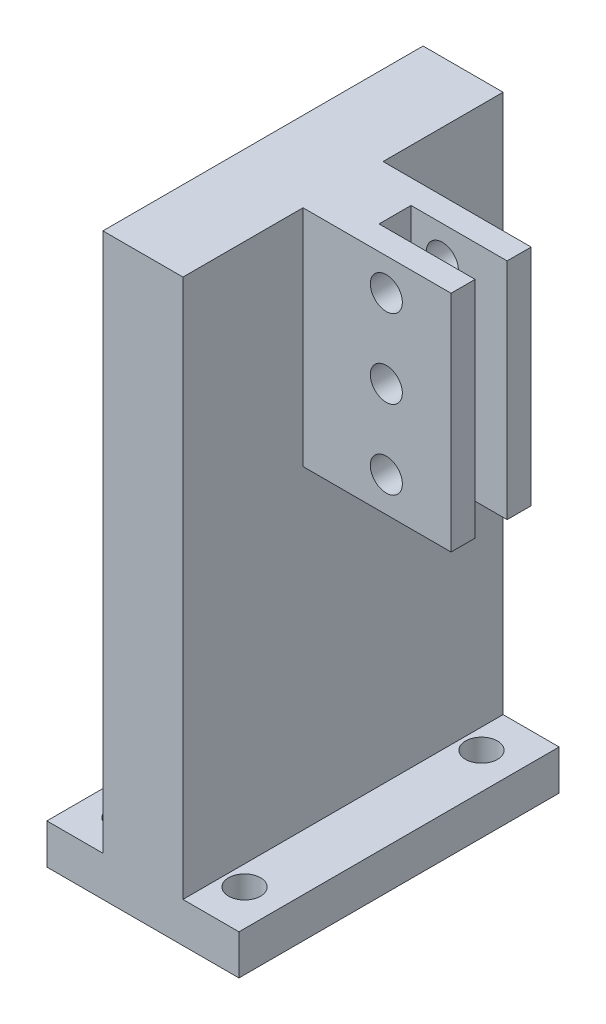
ISO-10303-21;
HEADER;
FILE_DESCRIPTION(('STEP AP214'),'2;1');
FILE_NAME('part.step','',(''),(''),'','','');
FILE_SCHEMA(('AUTOMOTIVE_DESIGN { 1 0 10303 214 1 1 1 1 }'));
ENDSEC;
DATA;
#1=APPLICATION_CONTEXT('core data for automotive mechanical design processes');
#2=APPLICATION_PROTOCOL_DEFINITION('international standard','automotive_design',2000,#1);
#3=PRODUCT_CONTEXT('',#1,'mechanical');
#4=PRODUCT('Part','Part','',(#3));
#5=PRODUCT_RELATED_PRODUCT_CATEGORY('part','',(#4));
#6=PRODUCT_DEFINITION_FORMATION('','',#4);
#7=PRODUCT_DEFINITION_CONTEXT('part definition',#1,'design');
#8=PRODUCT_DEFINITION('design','',#6,#7);
#9=PRODUCT_DEFINITION_SHAPE('','',#8);
#10=(LENGTH_UNIT() NAMED_UNIT(*) SI_UNIT(.MILLI.,.METRE.));
#11=(NAMED_UNIT(*) PLANE_ANGLE_UNIT() SI_UNIT($,.RADIAN.));
#12=(NAMED_UNIT(*) SI_UNIT($,.STERADIAN.) SOLID_ANGLE_UNIT());
#13=UNCERTAINTY_MEASURE_WITH_UNIT(LENGTH_MEASURE(1.E-05),#10,'distance_accuracy_value','');
#14=(GEOMETRIC_REPRESENTATION_CONTEXT(3) GLOBAL_UNCERTAINTY_ASSIGNED_CONTEXT((#13)) GLOBAL_UNIT_ASSIGNED_CONTEXT((#10,
#11,#12)) REPRESENTATION_CONTEXT('',''));
#15=CARTESIAN_POINT('',(0.,0.,0.));
#16=DIRECTION('',(0.,0.,1.));
#17=DIRECTION('',(1.,0.,0.));
#18=AXIS2_PLACEMENT_3D('',#15,#16,#17);
#19=CARTESIAN_POINT('',(0.,72.34,0.));
#20=DIRECTION('',(0.,1.,0.));
#21=DIRECTION('',(0.,0.,1.));
#22=AXIS2_PLACEMENT_3D('',#19,#20,#21);
#23=PLANE('',#22);
#24=DIRECTION('',(0.,0.,1.));
#25=VECTOR('',#24,1.);
#26=CARTESIAN_POINT('',(11.5,72.34,-2.));
#27=LINE('',#26,#25);
#28=CARTESIAN_POINT('',(11.5,72.34,-2.));
#29=VERTEX_POINT('',#28);
#30=CARTESIAN_POINT('',(11.5,72.34,2.));
#31=VERTEX_POINT('',#30);
#32=EDGE_CURVE('E174',#29,#31,#27,.T.);
#33=ORIENTED_EDGE('',*,*,#32,.F.);
#34=DIRECTION('',(-1.,0.,0.));
#35=VECTOR('',#34,1.);
#36=CARTESIAN_POINT('',(23.5,72.34,-2.));
#37=LINE('',#36,#35);
#38=CARTESIAN_POINT('',(23.5,72.34,-2.));
#39=VERTEX_POINT('',#38);
#40=EDGE_CURVE('E161',#39,#29,#37,.T.);
#41=ORIENTED_EDGE('',*,*,#40,.F.);
#42=DIRECTION('',(0.,0.,1.));
#43=VECTOR('',#42,1.);
#44=CARTESIAN_POINT('',(23.5,72.34,5.));
#45=LINE('',#44,#43);
#46=CARTESIAN_POINT('',(23.5,72.34,-5.));
#47=VERTEX_POINT('',#46);
#48=EDGE_CURVE('E172',#47,#39,#45,.T.);
#49=ORIENTED_EDGE('',*,*,#48,.F.);
#50=DIRECTION('',(-1.,0.,0.));
#51=VECTOR('',#50,1.);
#52=CARTESIAN_POINT('',(23.5,72.34,-5.));
#53=LINE('',#52,#51);
#54=CARTESIAN_POINT('',(5.,72.34,-5.));
#55=VERTEX_POINT('',#54);
#56=EDGE_CURVE('E215',#47,#55,#53,.T.);
#57=ORIENTED_EDGE('',*,*,#56,.T.);
#58=DIRECTION('',(0.,0.,-1.));
#59=VECTOR('',#58,1.);
#60=CARTESIAN_POINT('',(5.,72.34,20.));
#61=LINE('',#60,#59);
#62=CARTESIAN_POINT('',(5.,72.34,-20.));
#63=VERTEX_POINT('',#62);
#64=EDGE_CURVE('E223',#55,#63,#61,.T.);
#65=ORIENTED_EDGE('',*,*,#64,.T.);
#66=DIRECTION('',(-1.,0.,0.));
#67=VECTOR('',#66,1.);
#68=CARTESIAN_POINT('',(5.,72.34,-20.));
#69=LINE('',#68,#67);
#70=CARTESIAN_POINT('',(-5.,72.34,-20.));
#71=VERTEX_POINT('',#70);
#72=EDGE_CURVE('E229',#63,#71,#69,.T.);
#73=ORIENTED_EDGE('',*,*,#72,.T.);
#74=DIRECTION('',(0.,0.,1.));
#75=VECTOR('',#74,1.);
#76=CARTESIAN_POINT('',(-5.,72.34,-20.));
#77=LINE('',#76,#75);
#78=CARTESIAN_POINT('',(-5.,72.34,20.));
#79=VERTEX_POINT('',#78);
#80=EDGE_CURVE('E232',#71,#79,#77,.T.);
#81=ORIENTED_EDGE('',*,*,#80,.T.);
#82=DIRECTION('',(1.,0.,0.));
#83=VECTOR('',#82,1.);
#84=CARTESIAN_POINT('',(-5.,72.34,20.));
#85=LINE('',#84,#83);
#86=CARTESIAN_POINT('',(5.,72.34,20.));
#87=VERTEX_POINT('',#86);
#88=EDGE_CURVE('E219',#79,#87,#85,.T.);
#89=ORIENTED_EDGE('',*,*,#88,.T.);
#90=CARTESIAN_POINT('',(5.,72.34,5.));
#91=VERTEX_POINT('',#90);
#92=EDGE_CURVE('E225',#87,#91,#61,.T.);
#93=ORIENTED_EDGE('',*,*,#92,.T.);
#94=DIRECTION('',(-1.,0.,0.));
#95=VECTOR('',#94,1.);
#96=CARTESIAN_POINT('',(23.5,72.34,5.));
#97=LINE('',#96,#95);
#98=CARTESIAN_POINT('',(23.5,72.34,5.));
#99=VERTEX_POINT('',#98);
#100=EDGE_CURVE('E212',#99,#91,#97,.T.);
#101=ORIENTED_EDGE('',*,*,#100,.F.);
#102=CARTESIAN_POINT('',(23.5,72.34,2.));
#103=VERTEX_POINT('',#102);
#104=EDGE_CURVE('E183',#103,#99,#45,.T.);
#105=ORIENTED_EDGE('',*,*,#104,.F.);
#106=DIRECTION('',(-1.,0.,0.));
#107=VECTOR('',#106,1.);
#108=CARTESIAN_POINT('',(23.5,72.34,2.));
#109=LINE('',#108,#107);
#110=EDGE_CURVE('E55',#103,#31,#109,.T.);
#111=ORIENTED_EDGE('',*,*,#110,.T.);
#112=EDGE_LOOP('',(#33,#41,#49,#57,#65,#73,#81,#89,#93,#101,#105,#111));
#113=FACE_BOUND('',#112,.T.);
#114=ADVANCED_FACE('F37',(#113),#23,.T.);
#115=CARTESIAN_POINT('',(23.5,44.34,-5.));
#116=DIRECTION('',(0.,1.,0.));
#117=DIRECTION('',(0.,0.,1.));
#118=AXIS2_PLACEMENT_3D('',#115,#116,#117);
#119=PLANE('',#118);
#120=DIRECTION('',(1.,0.,0.));
#121=VECTOR('',#120,1.);
#122=CARTESIAN_POINT('',(11.5,44.34,-2.));
#123=LINE('',#122,#121);
#124=CARTESIAN_POINT('',(11.5,44.34,-2.));
#125=VERTEX_POINT('',#124);
#126=CARTESIAN_POINT('',(23.5,44.34,-2.));
#127=VERTEX_POINT('',#126);
#128=EDGE_CURVE('E164',#125,#127,#123,.T.);
#129=ORIENTED_EDGE('',*,*,#128,.F.);
#130=DIRECTION('',(0.,0.,1.));
#131=VECTOR('',#130,1.);
#132=CARTESIAN_POINT('',(11.5,44.34,-2.));
#133=LINE('',#132,#131);
#134=CARTESIAN_POINT('',(11.5,44.34,2.));
#135=VERTEX_POINT('',#134);
#136=EDGE_CURVE('E343',#125,#135,#133,.T.);
#137=ORIENTED_EDGE('',*,*,#136,.T.);
#138=DIRECTION('',(1.,0.,0.));
#139=VECTOR('',#138,1.);
#140=CARTESIAN_POINT('',(11.5,44.34,2.));
#141=LINE('',#140,#139);
#142=CARTESIAN_POINT('',(23.5,44.34,2.));
#143=VERTEX_POINT('',#142);
#144=EDGE_CURVE('E169',#135,#143,#141,.T.);
#145=ORIENTED_EDGE('',*,*,#144,.T.);
#146=DIRECTION('',(0.,0.,-1.));
#147=VECTOR('',#146,1.);
#148=CARTESIAN_POINT('',(23.5,44.34,-5.));
#149=LINE('',#148,#147);
#150=CARTESIAN_POINT('',(23.5,44.34,5.));
#151=VERTEX_POINT('',#150);
#152=EDGE_CURVE('E192',#151,#143,#149,.T.);
#153=ORIENTED_EDGE('',*,*,#152,.F.);
#154=DIRECTION('',(-1.,0.,0.));
#155=VECTOR('',#154,1.);
#156=CARTESIAN_POINT('',(23.5,44.34,5.));
#157=LINE('',#156,#155);
#158=CARTESIAN_POINT('',(5.,44.34,5.));
#159=VERTEX_POINT('',#158);
#160=EDGE_CURVE('E208',#151,#159,#157,.T.);
#161=ORIENTED_EDGE('',*,*,#160,.T.);
#162=DIRECTION('',(0.,0.,-1.));
#163=VECTOR('',#162,1.);
#164=CARTESIAN_POINT('',(5.,44.34,-5.));
#165=LINE('',#164,#163);
#166=CARTESIAN_POINT('',(5.,44.34,-5.));
#167=VERTEX_POINT('',#166);
#168=EDGE_CURVE('E203',#159,#167,#165,.T.);
#169=ORIENTED_EDGE('',*,*,#168,.T.);
#170=DIRECTION('',(-1.,0.,0.));
#171=VECTOR('',#170,1.);
#172=CARTESIAN_POINT('',(23.5,44.34,-5.));
#173=LINE('',#172,#171);
#174=CARTESIAN_POINT('',(23.5,44.34,-5.));
#175=VERTEX_POINT('',#174);
#176=EDGE_CURVE('E196',#175,#167,#173,.T.);
#177=ORIENTED_EDGE('',*,*,#176,.F.);
#178=EDGE_CURVE('E187',#127,#175,#149,.T.);
#179=ORIENTED_EDGE('',*,*,#178,.F.);
#180=EDGE_LOOP('',(#129,#137,#145,#153,#161,#169,#177,#179));
#181=FACE_BOUND('',#180,.T.);
#182=ADVANCED_FACE('F405',(#181),#119,.F.);
#183=CARTESIAN_POINT('',(23.5,0.,0.));
#184=DIRECTION('',(-1.,0.,0.));
#185=DIRECTION('',(0.,0.,1.));
#186=AXIS2_PLACEMENT_3D('',#183,#184,#185);
#187=PLANE('',#186);
#188=DIRECTION('',(0.,1.,0.));
#189=VECTOR('',#188,1.);
#190=CARTESIAN_POINT('',(23.5,44.34,-2.));
#191=LINE('',#190,#189);
#192=EDGE_CURVE('E156',#127,#39,#191,.T.);
#193=ORIENTED_EDGE('',*,*,#192,.F.);
#194=ORIENTED_EDGE('',*,*,#178,.T.);
#195=DIRECTION('',(0.,1.,0.));
#196=VECTOR('',#195,1.);
#197=CARTESIAN_POINT('',(23.5,72.34,-5.));
#198=LINE('',#197,#196);
#199=EDGE_CURVE('E180',#175,#47,#198,.T.);
#200=ORIENTED_EDGE('',*,*,#199,.T.);
#201=ORIENTED_EDGE('',*,*,#48,.T.);
#202=EDGE_LOOP('',(#193,#194,#200,#201));
#203=FACE_BOUND('',#202,.T.);
#204=ADVANCED_FACE('F178',(#203),#187,.F.);
#205=CARTESIAN_POINT('',(15.41,48.67,19.5));
#206=DIRECTION('',(0.,0.,-1.));
#207=DIRECTION('',(0.,1.,0.));
#208=AXIS2_PLACEMENT_3D('',#205,#206,#207);
#209=CYLINDRICAL_SURFACE('',#208,2.);
#210=CARTESIAN_POINT('',(15.41,48.67,-5.));
#211=DIRECTION('',(0.,0.,-1.));
#212=DIRECTION('',(0.,1.,0.));
#213=AXIS2_PLACEMENT_3D('',#210,#211,#212);
#214=CIRCLE('',#213,2.);
#215=CARTESIAN_POINT('',(15.41,50.67,-5.));
#216=VERTEX_POINT('',#215);
#217=EDGE_CURVE('E371',#216,#216,#214,.T.);
#218=ORIENTED_EDGE('',*,*,#217,.T.);
#219=EDGE_LOOP('',(#218));
#220=FACE_BOUND('',#219,.T.);
#221=CARTESIAN_POINT('',(15.41,48.67,-2.));
#222=DIRECTION('',(0.,0.,1.));
#223=DIRECTION('',(1.,0.,0.));
#224=AXIS2_PLACEMENT_3D('',#221,#222,#223);
#225=CIRCLE('',#224,2.);
#226=CARTESIAN_POINT('',(17.41,48.67,-2.));
#227=VERTEX_POINT('',#226);
#228=EDGE_CURVE('E367',#227,#227,#225,.F.);
#229=ORIENTED_EDGE('',*,*,#228,.F.);
#230=EDGE_LOOP('',(#229));
#231=FACE_BOUND('',#230,.T.);
#232=ADVANCED_FACE('F382',(#220,#231),#209,.F.);
#233=CARTESIAN_POINT('',(15.41,58.49,19.5));
#234=DIRECTION('',(0.,0.,-1.));
#235=DIRECTION('',(0.,1.,0.));
#236=AXIS2_PLACEMENT_3D('',#233,#234,#235);
#237=CYLINDRICAL_SURFACE('',#236,2.);
#238=CARTESIAN_POINT('',(15.41,58.49,-5.));
#239=DIRECTION('',(0.,0.,-1.));
#240=DIRECTION('',(0.,1.,0.));
#241=AXIS2_PLACEMENT_3D('',#238,#239,#240);
#242=CIRCLE('',#241,2.);
#243=CARTESIAN_POINT('',(15.41,60.49,-5.));
#244=VERTEX_POINT('',#243);
#245=EDGE_CURVE('E375',#244,#244,#242,.T.);
#246=ORIENTED_EDGE('',*,*,#245,.T.);
#247=EDGE_LOOP('',(#246));
#248=FACE_BOUND('',#247,.T.);
#249=CARTESIAN_POINT('',(15.41,58.49,-2.));
#250=DIRECTION('',(0.,0.,1.));
#251=DIRECTION('',(1.,0.,0.));
#252=AXIS2_PLACEMENT_3D('',#249,#250,#251);
#253=CIRCLE('',#252,2.);
#254=CARTESIAN_POINT('',(17.41,58.49,-2.));
#255=VERTEX_POINT('',#254);
#256=EDGE_CURVE('E363',#255,#255,#253,.F.);
#257=ORIENTED_EDGE('',*,*,#256,.F.);
#258=EDGE_LOOP('',(#257));
#259=FACE_BOUND('',#258,.T.);
#260=ADVANCED_FACE('F526',(#248,#259),#237,.F.);
#261=CARTESIAN_POINT('',(15.41,68.31,19.5));
#262=DIRECTION('',(0.,0.,-1.));
#263=DIRECTION('',(0.,1.,0.));
#264=AXIS2_PLACEMENT_3D('',#261,#262,#263);
#265=CYLINDRICAL_SURFACE('',#264,2.);
#266=CARTESIAN_POINT('',(15.41,68.31,-5.));
#267=DIRECTION('',(0.,0.,-1.));
#268=DIRECTION('',(0.,1.,0.));
#269=AXIS2_PLACEMENT_3D('',#266,#267,#268);
#270=CIRCLE('',#269,2.);
#271=CARTESIAN_POINT('',(15.41,70.31,-5.));
#272=VERTEX_POINT('',#271);
#273=EDGE_CURVE('E333',#272,#272,#270,.T.);
#274=ORIENTED_EDGE('',*,*,#273,.T.);
#275=EDGE_LOOP('',(#274));
#276=FACE_BOUND('',#275,.T.);
#277=CARTESIAN_POINT('',(15.41,68.31,-2.));
#278=DIRECTION('',(0.,0.,1.));
#279=DIRECTION('',(1.,0.,0.));
#280=AXIS2_PLACEMENT_3D('',#277,#278,#279);
#281=CIRCLE('',#280,2.);
#282=CARTESIAN_POINT('',(17.41,68.31,-2.));
#283=VERTEX_POINT('',#282);
#284=EDGE_CURVE('E41',#283,#283,#281,.F.);
#285=ORIENTED_EDGE('',*,*,#284,.F.);
#286=EDGE_LOOP('',(#285));
#287=FACE_BOUND('',#286,.T.);
#288=ADVANCED_FACE('F415',(#276,#287),#265,.F.);
#289=CARTESIAN_POINT('',(5.,72.34,20.));
#290=DIRECTION('',(-1.,0.,0.));
#291=DIRECTION('',(0.,0.,1.));
#292=AXIS2_PLACEMENT_3D('',#289,#290,#291);
#293=PLANE('',#292);
#294=DIRECTION('',(0.,1.,0.));
#295=VECTOR('',#294,1.);
#296=CARTESIAN_POINT('',(5.,72.34,-5.));
#297=LINE('',#296,#295);
#298=EDGE_CURVE('E63',#167,#55,#297,.T.);
#299=ORIENTED_EDGE('',*,*,#298,.F.);
#300=ORIENTED_EDGE('',*,*,#168,.F.);
#301=DIRECTION('',(0.,-1.,0.));
#302=VECTOR('',#301,1.);
#303=CARTESIAN_POINT('',(5.,44.34,5.));
#304=LINE('',#303,#302);
#305=EDGE_CURVE('E199',#91,#159,#304,.T.);
#306=ORIENTED_EDGE('',*,*,#305,.F.);
#307=ORIENTED_EDGE('',*,*,#92,.F.);
#308=DIRECTION('',(0.,-1.,0.));
#309=VECTOR('',#308,1.);
#310=CARTESIAN_POINT('',(5.,72.34,20.));
#311=LINE('',#310,#309);
#312=CARTESIAN_POINT('',(5.,5.,20.));
#313=VERTEX_POINT('',#312);
#314=EDGE_CURVE('E253',#87,#313,#311,.T.);
#315=ORIENTED_EDGE('',*,*,#314,.T.);
#316=DIRECTION('',(0.,0.,-1.));
#317=VECTOR('',#316,1.);
#318=CARTESIAN_POINT('',(5.,5.,20.));
#319=LINE('',#318,#317);
#320=CARTESIAN_POINT('',(5.,5.,-20.));
#321=VERTEX_POINT('',#320);
#322=EDGE_CURVE('E218',#313,#321,#319,.T.);
#323=ORIENTED_EDGE('',*,*,#322,.T.);
#324=DIRECTION('',(0.,-1.,0.));
#325=VECTOR('',#324,1.);
#326=CARTESIAN_POINT('',(5.,72.34,-20.));
#327=LINE('',#326,#325);
#328=EDGE_CURVE('E249',#63,#321,#327,.T.);
#329=ORIENTED_EDGE('',*,*,#328,.F.);
#330=ORIENTED_EDGE('',*,*,#64,.F.);
#331=EDGE_LOOP('',(#299,#300,#306,#307,#315,#323,#329,#330));
#332=FACE_BOUND('',#331,.T.);
#333=ADVANCED_FACE('F411',(#332),#293,.F.);
#334=CARTESIAN_POINT('',(0.,5.,0.));
#335=DIRECTION('',(0.,1.,0.));
#336=DIRECTION('',(0.,0.,1.));
#337=AXIS2_PLACEMENT_3D('',#334,#335,#336);
#338=PLANE('',#337);
#339=DIRECTION('',(0.,0.,1.));
#340=VECTOR('',#339,1.);
#341=CARTESIAN_POINT('',(-5.,5.,0.));
#342=LINE('',#341,#340);
#343=CARTESIAN_POINT('',(-4.99999999999999,5.,-20.));
#344=VERTEX_POINT('',#343);
#345=CARTESIAN_POINT('',(-5.,5.,20.));
#346=VERTEX_POINT('',#345);
#347=EDGE_CURVE('E224',#344,#346,#342,.T.);
#348=ORIENTED_EDGE('',*,*,#347,.F.);
#349=DIRECTION('',(-1.,0.,0.));
#350=VECTOR('',#349,1.);
#351=CARTESIAN_POINT('',(12.,5.,-20.));
#352=LINE('',#351,#350);
#353=CARTESIAN_POINT('',(-12.,5.,-20.));
#354=VERTEX_POINT('',#353);
#355=EDGE_CURVE('E294',#344,#354,#352,.T.);
#356=ORIENTED_EDGE('',*,*,#355,.T.);
#357=DIRECTION('',(0.,0.,1.));
#358=VECTOR('',#357,1.);
#359=CARTESIAN_POINT('',(-12.,5.,20.));
#360=LINE('',#359,#358);
#361=CARTESIAN_POINT('',(-12.,5.,20.));
#362=VERTEX_POINT('',#361);
#363=EDGE_CURVE('E299',#354,#362,#360,.T.);
#364=ORIENTED_EDGE('',*,*,#363,.T.);
#365=DIRECTION('',(1.,0.,0.));
#366=VECTOR('',#365,1.);
#367=CARTESIAN_POINT('',(12.,5.,20.));
#368=LINE('',#367,#366);
#369=EDGE_CURVE('E303',#362,#346,#368,.T.);
#370=ORIENTED_EDGE('',*,*,#369,.T.);
#371=EDGE_LOOP('',(#348,#356,#364,#370));
#372=FACE_BOUND('',#371,.T.);
#373=CARTESIAN_POINT('',(-7.5,5.,14.8));
#374=DIRECTION('',(0.,1.,0.));
#375=DIRECTION('',(0.,0.,1.));
#376=AXIS2_PLACEMENT_3D('',#373,#374,#375);
#377=CIRCLE('',#376,2.);
#378=CARTESIAN_POINT('',(-7.5,5.,16.8));
#379=VERTEX_POINT('',#378);
#380=EDGE_CURVE('E274',#379,#379,#377,.T.);
#381=ORIENTED_EDGE('',*,*,#380,.F.);
#382=EDGE_LOOP('',(#381));
#383=FACE_BOUND('',#382,.T.);
#384=CARTESIAN_POINT('',(-7.5,5.,-14.8));
#385=DIRECTION('',(0.,1.,0.));
#386=DIRECTION('',(0.,0.,-1.));
#387=AXIS2_PLACEMENT_3D('',#384,#385,#386);
#388=CIRCLE('',#387,2.);
#389=CARTESIAN_POINT('',(-7.5,5.,-16.8));
#390=VERTEX_POINT('',#389);
#391=EDGE_CURVE('E266',#390,#390,#388,.T.);
#392=ORIENTED_EDGE('',*,*,#391,.F.);
#393=EDGE_LOOP('',(#392));
#394=FACE_BOUND('',#393,.T.);
#395=ADVANCED_FACE('F414',(#372,#383,#394),#338,.T.);
#396=ORIENTED_EDGE('',*,*,#322,.F.);
#397=CARTESIAN_POINT('',(12.,5.,20.));
#398=VERTEX_POINT('',#397);
#399=EDGE_CURVE('E302',#313,#398,#368,.T.);
#400=ORIENTED_EDGE('',*,*,#399,.T.);
#401=DIRECTION('',(0.,0.,-1.));
#402=VECTOR('',#401,1.);
#403=CARTESIAN_POINT('',(12.,5.,20.));
#404=LINE('',#403,#402);
#405=CARTESIAN_POINT('',(12.,5.,-20.));
#406=VERTEX_POINT('',#405);
#407=EDGE_CURVE('E290',#398,#406,#404,.T.);
#408=ORIENTED_EDGE('',*,*,#407,.T.);
#409=EDGE_CURVE('E296',#406,#321,#352,.T.);
#410=ORIENTED_EDGE('',*,*,#409,.T.);
#411=EDGE_LOOP('',(#396,#400,#408,#410));
#412=FACE_BOUND('',#411,.T.);
#413=CARTESIAN_POINT('',(7.5,5.,14.8));
#414=DIRECTION('',(0.,1.,0.));
#415=DIRECTION('',(0.,0.,1.));
#416=AXIS2_PLACEMENT_3D('',#413,#414,#415);
#417=CIRCLE('',#416,2.);
#418=CARTESIAN_POINT('',(7.5,5.,16.8));
#419=VERTEX_POINT('',#418);
#420=EDGE_CURVE('E282',#419,#419,#417,.T.);
#421=ORIENTED_EDGE('',*,*,#420,.F.);
#422=EDGE_LOOP('',(#421));
#423=FACE_BOUND('',#422,.T.);
#424=CARTESIAN_POINT('',(7.5,5.,-14.8));
#425=DIRECTION('',(0.,1.,0.));
#426=DIRECTION('',(0.,0.,-1.));
#427=AXIS2_PLACEMENT_3D('',#424,#425,#426);
#428=CIRCLE('',#427,2.);
#429=CARTESIAN_POINT('',(7.5,5.,-16.8));
#430=VERTEX_POINT('',#429);
#431=EDGE_CURVE('E258',#430,#430,#428,.T.);
#432=ORIENTED_EDGE('',*,*,#431,.F.);
#433=EDGE_LOOP('',(#432));
#434=FACE_BOUND('',#433,.T.);
#435=ADVANCED_FACE('F433',(#412,#423,#434),#338,.T.);
#436=CARTESIAN_POINT('',(0.,0.,0.));
#437=DIRECTION('',(0.,1.,0.));
#438=DIRECTION('',(0.,0.,1.));
#439=AXIS2_PLACEMENT_3D('',#436,#437,#438);
#440=PLANE('',#439);
#441=DIRECTION('',(0.,0.,-1.));
#442=VECTOR('',#441,1.);
#443=CARTESIAN_POINT('',(12.,0.,20.));
#444=LINE('',#443,#442);
#445=CARTESIAN_POINT('',(12.,0.,20.));
#446=VERTEX_POINT('',#445);
#447=CARTESIAN_POINT('',(12.,0.,-20.));
#448=VERTEX_POINT('',#447);
#449=EDGE_CURVE('E286',#446,#448,#444,.T.);
#450=ORIENTED_EDGE('',*,*,#449,.F.);
#451=DIRECTION('',(1.,0.,0.));
#452=VECTOR('',#451,1.);
#453=CARTESIAN_POINT('',(12.,0.,20.));
#454=LINE('',#453,#452);
#455=CARTESIAN_POINT('',(-12.,0.,20.));
#456=VERTEX_POINT('',#455);
#457=EDGE_CURVE('E295',#456,#446,#454,.T.);
#458=ORIENTED_EDGE('',*,*,#457,.F.);
#459=DIRECTION('',(0.,0.,1.));
#460=VECTOR('',#459,1.);
#461=CARTESIAN_POINT('',(-12.,0.,20.));
#462=LINE('',#461,#460);
#463=CARTESIAN_POINT('',(-12.,0.,-20.));
#464=VERTEX_POINT('',#463);
#465=EDGE_CURVE('E313',#464,#456,#462,.T.);
#466=ORIENTED_EDGE('',*,*,#465,.F.);
#467=DIRECTION('',(-1.,0.,0.));
#468=VECTOR('',#467,1.);
#469=CARTESIAN_POINT('',(12.,0.,-20.));
#470=LINE('',#469,#468);
#471=EDGE_CURVE('E310',#448,#464,#470,.T.);
#472=ORIENTED_EDGE('',*,*,#471,.F.);
#473=EDGE_LOOP('',(#450,#458,#466,#472));
#474=FACE_BOUND('',#473,.T.);
#475=CARTESIAN_POINT('',(7.5,0.,14.8));
#476=DIRECTION('',(0.,1.,0.));
#477=DIRECTION('',(0.,0.,1.));
#478=AXIS2_PLACEMENT_3D('',#475,#476,#477);
#479=CIRCLE('',#478,2.);
#480=CARTESIAN_POINT('',(7.5,0.,16.8));
#481=VERTEX_POINT('',#480);
#482=EDGE_CURVE('E278',#481,#481,#479,.T.);
#483=ORIENTED_EDGE('',*,*,#482,.T.);
#484=EDGE_LOOP('',(#483));
#485=FACE_BOUND('',#484,.T.);
#486=CARTESIAN_POINT('',(-7.5,0.,14.8));
#487=DIRECTION('',(0.,1.,0.));
#488=DIRECTION('',(0.,0.,1.));
#489=AXIS2_PLACEMENT_3D('',#486,#487,#488);
#490=CIRCLE('',#489,2.);
#491=CARTESIAN_POINT('',(-7.5,0.,16.8));
#492=VERTEX_POINT('',#491);
#493=EDGE_CURVE('E270',#492,#492,#490,.T.);
#494=ORIENTED_EDGE('',*,*,#493,.T.);
#495=EDGE_LOOP('',(#494));
#496=FACE_BOUND('',#495,.T.);
#497=CARTESIAN_POINT('',(-7.5,0.,-14.8));
#498=DIRECTION('',(0.,1.,0.));
#499=DIRECTION('',(0.,0.,-1.));
#500=AXIS2_PLACEMENT_3D('',#497,#498,#499);
#501=CIRCLE('',#500,2.);
#502=CARTESIAN_POINT('',(-7.5,0.,-16.8));
#503=VERTEX_POINT('',#502);
#504=EDGE_CURVE('E262',#503,#503,#501,.T.);
#505=ORIENTED_EDGE('',*,*,#504,.T.);
#506=EDGE_LOOP('',(#505));
#507=FACE_BOUND('',#506,.T.);
#508=CARTESIAN_POINT('',(7.5,0.,-14.8));
#509=DIRECTION('',(0.,1.,0.));
#510=DIRECTION('',(0.,0.,-1.));
#511=AXIS2_PLACEMENT_3D('',#508,#509,#510);
#512=CIRCLE('',#511,2.);
#513=CARTESIAN_POINT('',(7.5,0.,-16.8));
#514=VERTEX_POINT('',#513);
#515=EDGE_CURVE('E257',#514,#514,#512,.T.);
#516=ORIENTED_EDGE('',*,*,#515,.T.);
#517=EDGE_LOOP('',(#516));
#518=FACE_BOUND('',#517,.T.);
#519=ADVANCED_FACE('F436',(#474,#485,#496,#507,#518),#440,.F.);
#520=CARTESIAN_POINT('',(12.,5.,20.));
#521=DIRECTION('',(-1.,0.,0.));
#522=DIRECTION('',(0.,0.,1.));
#523=AXIS2_PLACEMENT_3D('',#520,#521,#522);
#524=PLANE('',#523);
#525=ORIENTED_EDGE('',*,*,#449,.T.);
#526=DIRECTION('',(0.,-1.,0.));
#527=VECTOR('',#526,1.);
#528=CARTESIAN_POINT('',(12.,5.,-20.));
#529=LINE('',#528,#527);
#530=EDGE_CURVE('E11',#406,#448,#529,.T.);
#531=ORIENTED_EDGE('',*,*,#530,.F.);
#532=ORIENTED_EDGE('',*,*,#407,.F.);
#533=DIRECTION('',(0.,-1.,0.));
#534=VECTOR('',#533,1.);
#535=CARTESIAN_POINT('',(12.,5.,20.));
#536=LINE('',#535,#534);
#537=EDGE_CURVE('E306',#398,#446,#536,.T.);
#538=ORIENTED_EDGE('',*,*,#537,.T.);
#539=EDGE_LOOP('',(#525,#531,#532,#538));
#540=FACE_BOUND('',#539,.T.);
#541=ADVANCED_FACE('F39',(#540),#524,.F.);
#542=CARTESIAN_POINT('',(12.,5.,-20.));
#543=DIRECTION('',(0.,0.,1.));
#544=DIRECTION('',(1.,0.,0.));
#545=AXIS2_PLACEMENT_3D('',#542,#543,#544);
#546=PLANE('',#545);
#547=ORIENTED_EDGE('',*,*,#471,.T.);
#548=DIRECTION('',(0.,-1.,0.));
#549=VECTOR('',#548,1.);
#550=CARTESIAN_POINT('',(-12.,5.,-20.));
#551=LINE('',#550,#549);
#552=EDGE_CURVE('E47',#354,#464,#551,.T.);
#553=ORIENTED_EDGE('',*,*,#552,.F.);
#554=ORIENTED_EDGE('',*,*,#355,.F.);
#555=DIRECTION('',(0.,-1.,0.));
#556=VECTOR('',#555,1.);
#557=CARTESIAN_POINT('',(-5.,72.34,-20.));
#558=LINE('',#557,#556);
#559=EDGE_CURVE('E245',#71,#344,#558,.T.);
#560=ORIENTED_EDGE('',*,*,#559,.F.);
#561=ORIENTED_EDGE('',*,*,#72,.F.);
#562=ORIENTED_EDGE('',*,*,#328,.T.);
#563=ORIENTED_EDGE('',*,*,#409,.F.);
#564=ORIENTED_EDGE('',*,*,#530,.T.);
#565=EDGE_LOOP('',(#547,#553,#554,#560,#561,#562,#563,#564));
#566=FACE_BOUND('',#565,.T.);
#567=ADVANCED_FACE('F446',(#566),#546,.F.);
#568=CARTESIAN_POINT('',(-12.,5.,20.));
#569=DIRECTION('',(1.,0.,0.));
#570=DIRECTION('',(0.,0.,-1.));
#571=AXIS2_PLACEMENT_3D('',#568,#569,#570);
#572=PLANE('',#571);
#573=ORIENTED_EDGE('',*,*,#465,.T.);
#574=DIRECTION('',(0.,-1.,0.));
#575=VECTOR('',#574,1.);
#576=CARTESIAN_POINT('',(-12.,5.,20.));
#577=LINE('',#576,#575);
#578=EDGE_CURVE('E321',#362,#456,#577,.T.);
#579=ORIENTED_EDGE('',*,*,#578,.F.);
#580=ORIENTED_EDGE('',*,*,#363,.F.);
#581=ORIENTED_EDGE('',*,*,#552,.T.);
#582=EDGE_LOOP('',(#573,#579,#580,#581));
#583=FACE_BOUND('',#582,.T.);
#584=ADVANCED_FACE('F443',(#583),#572,.F.);
#585=CARTESIAN_POINT('',(12.,5.,20.));
#586=DIRECTION('',(0.,0.,-1.));
#587=DIRECTION('',(-1.,0.,0.));
#588=AXIS2_PLACEMENT_3D('',#585,#586,#587);
#589=PLANE('',#588);
#590=ORIENTED_EDGE('',*,*,#457,.T.);
#591=ORIENTED_EDGE('',*,*,#537,.F.);
#592=ORIENTED_EDGE('',*,*,#399,.F.);
#593=ORIENTED_EDGE('',*,*,#314,.F.);
#594=ORIENTED_EDGE('',*,*,#88,.F.);
#595=DIRECTION('',(0.,-1.,0.));
#596=VECTOR('',#595,1.);
#597=CARTESIAN_POINT('',(-5.,72.34,20.));
#598=LINE('',#597,#596);
#599=EDGE_CURVE('E235',#79,#346,#598,.T.);
#600=ORIENTED_EDGE('',*,*,#599,.T.);
#601=ORIENTED_EDGE('',*,*,#369,.F.);
#602=ORIENTED_EDGE('',*,*,#578,.T.);
#603=EDGE_LOOP('',(#590,#591,#592,#593,#594,#600,#601,#602));
#604=FACE_BOUND('',#603,.T.);
#605=ADVANCED_FACE('F431',(#604),#589,.F.);
#606=CARTESIAN_POINT('',(7.5,5.,14.8));
#607=DIRECTION('',(0.,-1.,0.));
#608=DIRECTION('',(0.,0.,-1.));
#609=AXIS2_PLACEMENT_3D('',#606,#607,#608);
#610=CYLINDRICAL_SURFACE('',#609,2.);
#611=ORIENTED_EDGE('',*,*,#420,.T.);
#612=EDGE_LOOP('',(#611));
#613=FACE_BOUND('',#612,.T.);
#614=ORIENTED_EDGE('',*,*,#482,.F.);
#615=EDGE_LOOP('',(#614));
#616=FACE_BOUND('',#615,.T.);
#617=ADVANCED_FACE('F427',(#613,#616),#610,.F.);
#618=CARTESIAN_POINT('',(-7.5,5.,14.8));
#619=DIRECTION('',(0.,-1.,0.));
#620=DIRECTION('',(0.,0.,-1.));
#621=AXIS2_PLACEMENT_3D('',#618,#619,#620);
#622=CYLINDRICAL_SURFACE('',#621,2.);
#623=ORIENTED_EDGE('',*,*,#380,.T.);
#624=EDGE_LOOP('',(#623));
#625=FACE_BOUND('',#624,.T.);
#626=ORIENTED_EDGE('',*,*,#493,.F.);
#627=EDGE_LOOP('',(#626));
#628=FACE_BOUND('',#627,.T.);
#629=ADVANCED_FACE('F423',(#625,#628),#622,.F.);
#630=CARTESIAN_POINT('',(-7.5,5.,-14.8));
#631=DIRECTION('',(0.,-1.,0.));
#632=DIRECTION('',(0.,0.,-1.));
#633=AXIS2_PLACEMENT_3D('',#630,#631,#632);
#634=CYLINDRICAL_SURFACE('',#633,2.);
#635=ORIENTED_EDGE('',*,*,#391,.T.);
#636=EDGE_LOOP('',(#635));
#637=FACE_BOUND('',#636,.T.);
#638=ORIENTED_EDGE('',*,*,#504,.F.);
#639=EDGE_LOOP('',(#638));
#640=FACE_BOUND('',#639,.T.);
#641=ADVANCED_FACE('F419',(#637,#640),#634,.F.);
#642=CARTESIAN_POINT('',(7.5,5.,-14.8));
#643=DIRECTION('',(0.,-1.,0.));
#644=DIRECTION('',(0.,0.,-1.));
#645=AXIS2_PLACEMENT_3D('',#642,#643,#644);
#646=CYLINDRICAL_SURFACE('',#645,2.);
#647=ORIENTED_EDGE('',*,*,#431,.T.);
#648=EDGE_LOOP('',(#647));
#649=FACE_BOUND('',#648,.T.);
#650=ORIENTED_EDGE('',*,*,#515,.F.);
#651=EDGE_LOOP('',(#650));
#652=FACE_BOUND('',#651,.T.);
#653=ADVANCED_FACE('F398',(#649,#652),#646,.F.);
#654=CARTESIAN_POINT('',(-5.,72.34,0.));
#655=DIRECTION('',(1.,0.,0.));
#656=DIRECTION('',(0.,0.,-1.));
#657=AXIS2_PLACEMENT_3D('',#654,#655,#656);
#658=PLANE('',#657);
#659=ORIENTED_EDGE('',*,*,#347,.T.);
#660=ORIENTED_EDGE('',*,*,#599,.F.);
#661=ORIENTED_EDGE('',*,*,#80,.F.);
#662=ORIENTED_EDGE('',*,*,#559,.T.);
#663=EDGE_LOOP('',(#659,#660,#661,#662));
#664=FACE_BOUND('',#663,.T.);
#665=ADVANCED_FACE('F388',(#664),#658,.F.);
#666=CARTESIAN_POINT('',(23.5,72.34,-5.));
#667=DIRECTION('',(0.,0.,1.));
#668=DIRECTION('',(0.,-1.,0.));
#669=AXIS2_PLACEMENT_3D('',#666,#667,#668);
#670=PLANE('',#669);
#671=ORIENTED_EDGE('',*,*,#273,.F.);
#672=EDGE_LOOP('',(#671));
#673=FACE_BOUND('',#672,.T.);
#674=ORIENTED_EDGE('',*,*,#245,.F.);
#675=EDGE_LOOP('',(#674));
#676=FACE_BOUND('',#675,.T.);
#677=ORIENTED_EDGE('',*,*,#217,.F.);
#678=EDGE_LOOP('',(#677));
#679=FACE_BOUND('',#678,.T.);
#680=ORIENTED_EDGE('',*,*,#298,.T.);
#681=ORIENTED_EDGE('',*,*,#56,.F.);
#682=ORIENTED_EDGE('',*,*,#199,.F.);
#683=ORIENTED_EDGE('',*,*,#176,.T.);
#684=EDGE_LOOP('',(#680,#681,#682,#683));
#685=FACE_BOUND('',#684,.T.);
#686=ADVANCED_FACE('F385',(#673,#676,#679,#685),#670,.F.);
#687=CARTESIAN_POINT('',(23.5,44.34,5.));
#688=DIRECTION('',(0.,0.,-1.));
#689=DIRECTION('',(0.,1.,0.));
#690=AXIS2_PLACEMENT_3D('',#687,#688,#689);
#691=PLANE('',#690);
#692=CARTESIAN_POINT('',(15.41,68.31,5.));
#693=DIRECTION('',(0.,0.,-1.));
#694=DIRECTION('',(0.,1.,0.));
#695=AXIS2_PLACEMENT_3D('',#692,#693,#694);
#696=CIRCLE('',#695,2.);
#697=CARTESIAN_POINT('',(15.41,70.31,5.));
#698=VERTEX_POINT('',#697);
#699=EDGE_CURVE('E200',#698,#698,#696,.T.);
#700=ORIENTED_EDGE('',*,*,#699,.T.);
#701=EDGE_LOOP('',(#700));
#702=FACE_BOUND('',#701,.T.);
#703=CARTESIAN_POINT('',(15.41,58.49,5.));
#704=DIRECTION('',(0.,0.,-1.));
#705=DIRECTION('',(0.,1.,0.));
#706=AXIS2_PLACEMENT_3D('',#703,#704,#705);
#707=CIRCLE('',#706,2.);
#708=CARTESIAN_POINT('',(15.41,60.49,5.));
#709=VERTEX_POINT('',#708);
#710=EDGE_CURVE('E332',#709,#709,#707,.T.);
#711=ORIENTED_EDGE('',*,*,#710,.T.);
#712=EDGE_LOOP('',(#711));
#713=FACE_BOUND('',#712,.T.);
#714=CARTESIAN_POINT('',(15.41,48.67,5.));
#715=DIRECTION('',(0.,0.,-1.));
#716=DIRECTION('',(0.,1.,0.));
#717=AXIS2_PLACEMENT_3D('',#714,#715,#716);
#718=CIRCLE('',#717,2.);
#719=CARTESIAN_POINT('',(15.41,50.67,5.));
#720=VERTEX_POINT('',#719);
#721=EDGE_CURVE('E328',#720,#720,#718,.T.);
#722=ORIENTED_EDGE('',*,*,#721,.T.);
#723=EDGE_LOOP('',(#722));
#724=FACE_BOUND('',#723,.T.);
#725=ORIENTED_EDGE('',*,*,#305,.T.);
#726=ORIENTED_EDGE('',*,*,#160,.F.);
#727=DIRECTION('',(0.,-1.,0.));
#728=VECTOR('',#727,1.);
#729=CARTESIAN_POINT('',(23.5,44.34,5.));
#730=LINE('',#729,#728);
#731=EDGE_CURVE('E182',#99,#151,#730,.T.);
#732=ORIENTED_EDGE('',*,*,#731,.F.);
#733=ORIENTED_EDGE('',*,*,#100,.T.);
#734=EDGE_LOOP('',(#725,#726,#732,#733));
#735=FACE_BOUND('',#734,.T.);
#736=ADVANCED_FACE('F387',(#702,#713,#724,#735),#691,.F.);
#737=ORIENTED_EDGE('',*,*,#152,.T.);
#738=DIRECTION('',(0.,1.,0.));
#739=VECTOR('',#738,1.);
#740=CARTESIAN_POINT('',(23.5,44.34,2.));
#741=LINE('',#740,#739);
#742=EDGE_CURVE('E491',#143,#103,#741,.T.);
#743=ORIENTED_EDGE('',*,*,#742,.T.);
#744=ORIENTED_EDGE('',*,*,#104,.T.);
#745=ORIENTED_EDGE('',*,*,#731,.T.);
#746=EDGE_LOOP('',(#737,#743,#744,#745));
#747=FACE_BOUND('',#746,.T.);
#748=ADVANCED_FACE('F395',(#747),#187,.F.);
#749=CARTESIAN_POINT('',(15.41,48.67,2.));
#750=DIRECTION('',(0.,0.,1.));
#751=DIRECTION('',(1.,0.,0.));
#752=AXIS2_PLACEMENT_3D('',#749,#750,#751);
#753=CIRCLE('',#752,2.);
#754=CARTESIAN_POINT('',(17.41,48.67,2.));
#755=VERTEX_POINT('',#754);
#756=EDGE_CURVE('E349',#755,#755,#753,.F.);
#757=ORIENTED_EDGE('',*,*,#756,.T.);
#758=EDGE_LOOP('',(#757));
#759=FACE_BOUND('',#758,.T.);
#760=ORIENTED_EDGE('',*,*,#721,.F.);
#761=EDGE_LOOP('',(#760));
#762=FACE_BOUND('',#761,.T.);
#763=ADVANCED_FACE('F512',(#759,#762),#209,.F.);
#764=CARTESIAN_POINT('',(15.41,58.49,2.));
#765=DIRECTION('',(0.,0.,1.));
#766=DIRECTION('',(1.,0.,0.));
#767=AXIS2_PLACEMENT_3D('',#764,#765,#766);
#768=CIRCLE('',#767,2.);
#769=CARTESIAN_POINT('',(17.41,58.49,2.));
#770=VERTEX_POINT('',#769);
#771=EDGE_CURVE('E342',#770,#770,#768,.F.);
#772=ORIENTED_EDGE('',*,*,#771,.T.);
#773=EDGE_LOOP('',(#772));
#774=FACE_BOUND('',#773,.T.);
#775=ORIENTED_EDGE('',*,*,#710,.F.);
#776=EDGE_LOOP('',(#775));
#777=FACE_BOUND('',#776,.T.);
#778=ADVANCED_FACE('F515',(#774,#777),#237,.F.);
#779=CARTESIAN_POINT('',(15.41,68.31,2.));
#780=DIRECTION('',(0.,0.,1.));
#781=DIRECTION('',(1.,0.,0.));
#782=AXIS2_PLACEMENT_3D('',#779,#780,#781);
#783=CIRCLE('',#782,2.);
#784=CARTESIAN_POINT('',(17.41,68.31,2.));
#785=VERTEX_POINT('',#784);
#786=EDGE_CURVE('E339',#785,#785,#783,.F.);
#787=ORIENTED_EDGE('',*,*,#786,.T.);
#788=EDGE_LOOP('',(#787));
#789=FACE_BOUND('',#788,.T.);
#790=ORIENTED_EDGE('',*,*,#699,.F.);
#791=EDGE_LOOP('',(#790));
#792=FACE_BOUND('',#791,.T.);
#793=ADVANCED_FACE('F523',(#789,#792),#265,.F.);
#794=CARTESIAN_POINT('',(0.,0.,-2.));
#795=DIRECTION('',(0.,0.,1.));
#796=DIRECTION('',(1.,0.,0.));
#797=AXIS2_PLACEMENT_3D('',#794,#795,#796);
#798=PLANE('',#797);
#799=ORIENTED_EDGE('',*,*,#192,.T.);
#800=ORIENTED_EDGE('',*,*,#40,.T.);
#801=DIRECTION('',(0.,-1.,0.));
#802=VECTOR('',#801,1.);
#803=CARTESIAN_POINT('',(11.5,72.34,-2.));
#804=LINE('',#803,#802);
#805=EDGE_CURVE('E176',#29,#125,#804,.T.);
#806=ORIENTED_EDGE('',*,*,#805,.T.);
#807=ORIENTED_EDGE('',*,*,#128,.T.);
#808=EDGE_LOOP('',(#799,#800,#806,#807));
#809=FACE_BOUND('',#808,.T.);
#810=ORIENTED_EDGE('',*,*,#284,.T.);
#811=EDGE_LOOP('',(#810));
#812=FACE_BOUND('',#811,.T.);
#813=ORIENTED_EDGE('',*,*,#256,.T.);
#814=EDGE_LOOP('',(#813));
#815=FACE_BOUND('',#814,.T.);
#816=ORIENTED_EDGE('',*,*,#228,.T.);
#817=EDGE_LOOP('',(#816));
#818=FACE_BOUND('',#817,.T.);
#819=ADVANCED_FACE('F158',(#809,#812,#815,#818),#798,.T.);
#820=CARTESIAN_POINT('',(0.,0.,2.));
#821=DIRECTION('',(0.,0.,1.));
#822=DIRECTION('',(1.,0.,0.));
#823=AXIS2_PLACEMENT_3D('',#820,#821,#822);
#824=PLANE('',#823);
#825=ORIENTED_EDGE('',*,*,#771,.F.);
#826=EDGE_LOOP('',(#825));
#827=FACE_BOUND('',#826,.T.);
#828=ORIENTED_EDGE('',*,*,#742,.F.);
#829=ORIENTED_EDGE('',*,*,#144,.F.);
#830=DIRECTION('',(0.,-1.,0.));
#831=VECTOR('',#830,1.);
#832=CARTESIAN_POINT('',(11.5,72.34,2.));
#833=LINE('',#832,#831);
#834=EDGE_CURVE('E496',#31,#135,#833,.T.);
#835=ORIENTED_EDGE('',*,*,#834,.F.);
#836=ORIENTED_EDGE('',*,*,#110,.F.);
#837=EDGE_LOOP('',(#828,#829,#835,#836));
#838=FACE_BOUND('',#837,.T.);
#839=ORIENTED_EDGE('',*,*,#786,.F.);
#840=EDGE_LOOP('',(#839));
#841=FACE_BOUND('',#840,.T.);
#842=ORIENTED_EDGE('',*,*,#756,.F.);
#843=EDGE_LOOP('',(#842));
#844=FACE_BOUND('',#843,.T.);
#845=ADVANCED_FACE('F503',(#827,#838,#841,#844),#824,.F.);
#846=CARTESIAN_POINT('',(11.5,72.34,-2.));
#847=DIRECTION('',(-1.,0.,0.));
#848=DIRECTION('',(0.,0.,1.));
#849=AXIS2_PLACEMENT_3D('',#846,#847,#848);
#850=PLANE('',#849);
#851=ORIENTED_EDGE('',*,*,#834,.T.);
#852=ORIENTED_EDGE('',*,*,#136,.F.);
#853=ORIENTED_EDGE('',*,*,#805,.F.);
#854=ORIENTED_EDGE('',*,*,#32,.T.);
#855=EDGE_LOOP('',(#851,#852,#853,#854));
#856=FACE_BOUND('',#855,.T.);
#857=ADVANCED_FACE('F506',(#856),#850,.F.);
#858=CLOSED_SHELL('',(#114,#182,#204,#232,#260,#288,#333,#395,#435,#519,#541,#567,#584,#605,
#617,#629,#641,#653,#665,#686,#736,#748,#763,#778,#793,#819,#845,#857));
#859=MANIFOLD_SOLID_BREP('B2',#858);
#860=ADVANCED_BREP_SHAPE_REPRESENTATION('',(#18,#859),#14);
#861=SHAPE_DEFINITION_REPRESENTATION(#9,#860);
ENDSEC;
END-ISO-10303-21;
